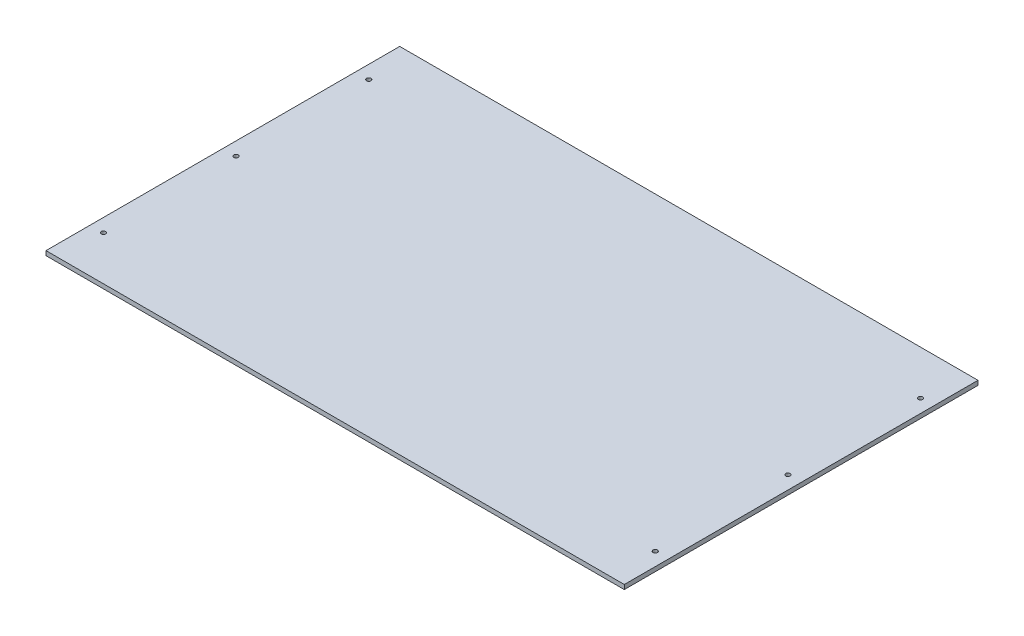
ISO-10303-21;
HEADER;
FILE_DESCRIPTION(('STEP AP214'),'2;1');
FILE_NAME('part.step','',(''),(''),'','','');
FILE_SCHEMA(('AUTOMOTIVE_DESIGN { 1 0 10303 214 1 1 1 1 }'));
ENDSEC;
DATA;
#1=APPLICATION_CONTEXT('core data for automotive mechanical design processes');
#2=APPLICATION_PROTOCOL_DEFINITION('international standard','automotive_design',2000,#1);
#3=PRODUCT_CONTEXT('',#1,'mechanical');
#4=PRODUCT('Part','Part','',(#3));
#5=PRODUCT_RELATED_PRODUCT_CATEGORY('part','',(#4));
#6=PRODUCT_DEFINITION_FORMATION('','',#4);
#7=PRODUCT_DEFINITION_CONTEXT('part definition',#1,'design');
#8=PRODUCT_DEFINITION('design','',#6,#7);
#9=PRODUCT_DEFINITION_SHAPE('','',#8);
#10=(LENGTH_UNIT() NAMED_UNIT(*) SI_UNIT(.MILLI.,.METRE.));
#11=(NAMED_UNIT(*) PLANE_ANGLE_UNIT() SI_UNIT($,.RADIAN.));
#12=(NAMED_UNIT(*) SI_UNIT($,.STERADIAN.) SOLID_ANGLE_UNIT());
#13=UNCERTAINTY_MEASURE_WITH_UNIT(LENGTH_MEASURE(1.E-05),#10,'distance_accuracy_value','');
#14=(GEOMETRIC_REPRESENTATION_CONTEXT(3) GLOBAL_UNCERTAINTY_ASSIGNED_CONTEXT((#13)) GLOBAL_UNIT_ASSIGNED_CONTEXT((#10,
#11,#12)) REPRESENTATION_CONTEXT('',''));
#15=CARTESIAN_POINT('',(0.,0.,0.));
#16=DIRECTION('',(0.,0.,1.));
#17=DIRECTION('',(1.,0.,0.));
#18=AXIS2_PLACEMENT_3D('',#15,#16,#17);
#19=CARTESIAN_POINT('',(0.,5.,0.));
#20=DIRECTION('',(1.,0.,0.));
#21=DIRECTION('',(0.,0.,-1.));
#22=AXIS2_PLACEMENT_3D('',#19,#20,#21);
#23=PLANE('',#22);
#24=DIRECTION('',(0.,0.,1.));
#25=VECTOR('',#24,1.);
#26=CARTESIAN_POINT('',(0.,0.,0.));
#27=LINE('',#26,#25);
#28=CARTESIAN_POINT('',(0.,0.,-400.));
#29=VERTEX_POINT('',#28);
#30=CARTESIAN_POINT('',(0.,0.,0.));
#31=VERTEX_POINT('',#30);
#32=EDGE_CURVE('E100',#29,#31,#27,.T.);
#33=ORIENTED_EDGE('',*,*,#32,.T.);
#34=DIRECTION('',(0.,-1.,0.));
#35=VECTOR('',#34,1.);
#36=CARTESIAN_POINT('',(0.,5.,0.));
#37=LINE('',#36,#35);
#38=CARTESIAN_POINT('',(0.,5.,0.));
#39=VERTEX_POINT('',#38);
#40=EDGE_CURVE('E11',#39,#31,#37,.T.);
#41=ORIENTED_EDGE('',*,*,#40,.F.);
#42=DIRECTION('',(0.,0.,1.));
#43=VECTOR('',#42,1.);
#44=CARTESIAN_POINT('',(0.,5.,0.));
#45=LINE('',#44,#43);
#46=CARTESIAN_POINT('',(0.,5.,-400.));
#47=VERTEX_POINT('',#46);
#48=EDGE_CURVE('E88',#47,#39,#45,.T.);
#49=ORIENTED_EDGE('',*,*,#48,.F.);
#50=DIRECTION('',(0.,-1.,0.));
#51=VECTOR('',#50,1.);
#52=CARTESIAN_POINT('',(0.,5.,-400.));
#53=LINE('',#52,#51);
#54=EDGE_CURVE('E96',#47,#29,#53,.T.);
#55=ORIENTED_EDGE('',*,*,#54,.T.);
#56=EDGE_LOOP('',(#33,#41,#49,#55));
#57=FACE_BOUND('',#56,.T.);
#58=ADVANCED_FACE('F37',(#57),#23,.F.);
#59=CARTESIAN_POINT('',(0.,5.,0.));
#60=DIRECTION('',(0.,0.,-1.));
#61=DIRECTION('',(-1.,0.,0.));
#62=AXIS2_PLACEMENT_3D('',#59,#60,#61);
#63=PLANE('',#62);
#64=DIRECTION('',(1.,0.,0.));
#65=VECTOR('',#64,1.);
#66=CARTESIAN_POINT('',(0.,0.,0.));
#67=LINE('',#66,#65);
#68=CARTESIAN_POINT('',(654.,0.,0.));
#69=VERTEX_POINT('',#68);
#70=EDGE_CURVE('E92',#31,#69,#67,.T.);
#71=ORIENTED_EDGE('',*,*,#70,.T.);
#72=DIRECTION('',(0.,-1.,0.));
#73=VECTOR('',#72,1.);
#74=CARTESIAN_POINT('',(654.,5.,0.));
#75=LINE('',#74,#73);
#76=CARTESIAN_POINT('',(654.,5.,0.));
#77=VERTEX_POINT('',#76);
#78=EDGE_CURVE('E45',#77,#69,#75,.T.);
#79=ORIENTED_EDGE('',*,*,#78,.F.);
#80=DIRECTION('',(1.,0.,0.));
#81=VECTOR('',#80,1.);
#82=CARTESIAN_POINT('',(0.,5.,0.));
#83=LINE('',#82,#81);
#84=EDGE_CURVE('E83',#39,#77,#83,.T.);
#85=ORIENTED_EDGE('',*,*,#84,.F.);
#86=ORIENTED_EDGE('',*,*,#40,.T.);
#87=EDGE_LOOP('',(#71,#79,#85,#86));
#88=FACE_BOUND('',#87,.T.);
#89=ADVANCED_FACE('F91',(#88),#63,.F.);
#90=CARTESIAN_POINT('',(654.,5.,0.));
#91=DIRECTION('',(-1.,0.,0.));
#92=DIRECTION('',(0.,0.,1.));
#93=AXIS2_PLACEMENT_3D('',#90,#91,#92);
#94=PLANE('',#93);
#95=DIRECTION('',(0.,0.,-1.));
#96=VECTOR('',#95,1.);
#97=CARTESIAN_POINT('',(654.,0.,0.));
#98=LINE('',#97,#96);
#99=CARTESIAN_POINT('',(654.,0.,-400.));
#100=VERTEX_POINT('',#99);
#101=EDGE_CURVE('E70',#69,#100,#98,.T.);
#102=ORIENTED_EDGE('',*,*,#101,.T.);
#103=DIRECTION('',(0.,-1.,0.));
#104=VECTOR('',#103,1.);
#105=CARTESIAN_POINT('',(654.,5.,-400.));
#106=LINE('',#105,#104);
#107=CARTESIAN_POINT('',(654.,5.,-400.));
#108=VERTEX_POINT('',#107);
#109=EDGE_CURVE('E93',#108,#100,#106,.T.);
#110=ORIENTED_EDGE('',*,*,#109,.F.);
#111=DIRECTION('',(0.,0.,-1.));
#112=VECTOR('',#111,1.);
#113=CARTESIAN_POINT('',(654.,5.,0.));
#114=LINE('',#113,#112);
#115=EDGE_CURVE('E86',#77,#108,#114,.T.);
#116=ORIENTED_EDGE('',*,*,#115,.F.);
#117=ORIENTED_EDGE('',*,*,#78,.T.);
#118=EDGE_LOOP('',(#102,#110,#116,#117));
#119=FACE_BOUND('',#118,.T.);
#120=ADVANCED_FACE('F94',(#119),#94,.F.);
#121=CARTESIAN_POINT('',(0.,5.,-400.));
#122=DIRECTION('',(0.,0.,1.));
#123=DIRECTION('',(1.,0.,0.));
#124=AXIS2_PLACEMENT_3D('',#121,#122,#123);
#125=PLANE('',#124);
#126=DIRECTION('',(-1.,0.,0.));
#127=VECTOR('',#126,1.);
#128=CARTESIAN_POINT('',(0.,0.,-400.));
#129=LINE('',#128,#127);
#130=EDGE_CURVE('E76',#100,#29,#129,.T.);
#131=ORIENTED_EDGE('',*,*,#130,.T.);
#132=ORIENTED_EDGE('',*,*,#54,.F.);
#133=DIRECTION('',(-1.,0.,0.));
#134=VECTOR('',#133,1.);
#135=CARTESIAN_POINT('',(0.,5.,-400.));
#136=LINE('',#135,#134);
#137=EDGE_CURVE('E53',#108,#47,#136,.T.);
#138=ORIENTED_EDGE('',*,*,#137,.F.);
#139=ORIENTED_EDGE('',*,*,#109,.T.);
#140=EDGE_LOOP('',(#131,#132,#138,#139));
#141=FACE_BOUND('',#140,.T.);
#142=ADVANCED_FACE('F108',(#141),#125,.F.);
#143=CARTESIAN_POINT('',(0.,5.,0.));
#144=DIRECTION('',(0.,-1.,0.));
#145=DIRECTION('',(0.,0.,-1.));
#146=AXIS2_PLACEMENT_3D('',#143,#144,#145);
#147=PLANE('',#146);
#148=CARTESIAN_POINT('',(639.,5.,-200.));
#149=DIRECTION('',(0.,1.,0.));
#150=DIRECTION('',(0.,0.,1.));
#151=AXIS2_PLACEMENT_3D('',#148,#149,#150);
#152=CIRCLE('',#151,2.49999999999991);
#153=CARTESIAN_POINT('',(639.,5.,-197.5));
#154=VERTEX_POINT('',#153);
#155=EDGE_CURVE('E117',#154,#154,#152,.T.);
#156=ORIENTED_EDGE('',*,*,#155,.F.);
#157=EDGE_LOOP('',(#156));
#158=FACE_BOUND('',#157,.T.);
#159=CARTESIAN_POINT('',(639.,5.,-50.));
#160=DIRECTION('',(0.,1.,0.));
#161=DIRECTION('',(0.,0.,1.));
#162=AXIS2_PLACEMENT_3D('',#159,#160,#161);
#163=CIRCLE('',#162,2.49999999999991);
#164=CARTESIAN_POINT('',(639.,5.,-47.5000000000001));
#165=VERTEX_POINT('',#164);
#166=EDGE_CURVE('E136',#165,#165,#163,.T.);
#167=ORIENTED_EDGE('',*,*,#166,.F.);
#168=EDGE_LOOP('',(#167));
#169=FACE_BOUND('',#168,.T.);
#170=CARTESIAN_POINT('',(15.,5.,-350.));
#171=DIRECTION('',(0.,1.,0.));
#172=DIRECTION('',(0.,0.,1.));
#173=AXIS2_PLACEMENT_3D('',#170,#171,#172);
#174=CIRCLE('',#173,2.5);
#175=CARTESIAN_POINT('',(15.,5.,-347.5));
#176=VERTEX_POINT('',#175);
#177=EDGE_CURVE('E130',#176,#176,#174,.T.);
#178=ORIENTED_EDGE('',*,*,#177,.F.);
#179=EDGE_LOOP('',(#178));
#180=FACE_BOUND('',#179,.T.);
#181=CARTESIAN_POINT('',(15.,5.,-200.));
#182=DIRECTION('',(0.,1.,0.));
#183=DIRECTION('',(0.,0.,1.));
#184=AXIS2_PLACEMENT_3D('',#181,#182,#183);
#185=CIRCLE('',#184,2.5);
#186=CARTESIAN_POINT('',(15.,5.,-197.5));
#187=VERTEX_POINT('',#186);
#188=EDGE_CURVE('E123',#187,#187,#185,.T.);
#189=ORIENTED_EDGE('',*,*,#188,.F.);
#190=EDGE_LOOP('',(#189));
#191=FACE_BOUND('',#190,.T.);
#192=CARTESIAN_POINT('',(15.,5.,-50.));
#193=DIRECTION('',(0.,1.,0.));
#194=DIRECTION('',(0.,0.,1.));
#195=AXIS2_PLACEMENT_3D('',#192,#193,#194);
#196=CIRCLE('',#195,2.5);
#197=CARTESIAN_POINT('',(15.,5.,-47.5));
#198=VERTEX_POINT('',#197);
#199=EDGE_CURVE('E124',#198,#198,#196,.T.);
#200=ORIENTED_EDGE('',*,*,#199,.F.);
#201=EDGE_LOOP('',(#200));
#202=FACE_BOUND('',#201,.T.);
#203=CARTESIAN_POINT('',(639.,5.,-350.));
#204=DIRECTION('',(0.,1.,0.));
#205=DIRECTION('',(0.,0.,1.));
#206=AXIS2_PLACEMENT_3D('',#203,#204,#205);
#207=CIRCLE('',#206,2.49999999999992);
#208=CARTESIAN_POINT('',(639.,5.,-347.5));
#209=VERTEX_POINT('',#208);
#210=EDGE_CURVE('E114',#209,#209,#207,.T.);
#211=ORIENTED_EDGE('',*,*,#210,.F.);
#212=EDGE_LOOP('',(#211));
#213=FACE_BOUND('',#212,.T.);
#214=ORIENTED_EDGE('',*,*,#48,.T.);
#215=ORIENTED_EDGE('',*,*,#84,.T.);
#216=ORIENTED_EDGE('',*,*,#115,.T.);
#217=ORIENTED_EDGE('',*,*,#137,.T.);
#218=EDGE_LOOP('',(#214,#215,#216,#217));
#219=FACE_BOUND('',#218,.T.);
#220=ADVANCED_FACE('F84',(#158,#169,#180,#191,#202,#213,#219),#147,.F.);
#221=CARTESIAN_POINT('',(0.,0.,0.));
#222=DIRECTION('',(0.,-1.,0.));
#223=DIRECTION('',(0.,0.,-1.));
#224=AXIS2_PLACEMENT_3D('',#221,#222,#223);
#225=PLANE('',#224);
#226=CARTESIAN_POINT('',(639.,0.,-200.));
#227=DIRECTION('',(0.,1.,0.));
#228=DIRECTION('',(0.,0.,1.));
#229=AXIS2_PLACEMENT_3D('',#226,#227,#228);
#230=CIRCLE('',#229,2.49999999999991);
#231=CARTESIAN_POINT('',(639.,0.,-197.5));
#232=VERTEX_POINT('',#231);
#233=EDGE_CURVE('E139',#232,#232,#230,.T.);
#234=ORIENTED_EDGE('',*,*,#233,.T.);
#235=EDGE_LOOP('',(#234));
#236=FACE_BOUND('',#235,.T.);
#237=CARTESIAN_POINT('',(639.,0.,-50.));
#238=DIRECTION('',(0.,1.,0.));
#239=DIRECTION('',(0.,0.,1.));
#240=AXIS2_PLACEMENT_3D('',#237,#238,#239);
#241=CIRCLE('',#240,2.49999999999991);
#242=CARTESIAN_POINT('',(639.,0.,-47.5000000000001));
#243=VERTEX_POINT('',#242);
#244=EDGE_CURVE('E133',#243,#243,#241,.T.);
#245=ORIENTED_EDGE('',*,*,#244,.T.);
#246=EDGE_LOOP('',(#245));
#247=FACE_BOUND('',#246,.T.);
#248=CARTESIAN_POINT('',(15.,0.,-350.));
#249=DIRECTION('',(0.,1.,0.));
#250=DIRECTION('',(0.,0.,1.));
#251=AXIS2_PLACEMENT_3D('',#248,#249,#250);
#252=CIRCLE('',#251,2.5);
#253=CARTESIAN_POINT('',(15.,0.,-347.5));
#254=VERTEX_POINT('',#253);
#255=EDGE_CURVE('E127',#254,#254,#252,.T.);
#256=ORIENTED_EDGE('',*,*,#255,.T.);
#257=EDGE_LOOP('',(#256));
#258=FACE_BOUND('',#257,.T.);
#259=CARTESIAN_POINT('',(15.,0.,-200.));
#260=DIRECTION('',(0.,1.,0.));
#261=DIRECTION('',(0.,0.,1.));
#262=AXIS2_PLACEMENT_3D('',#259,#260,#261);
#263=CIRCLE('',#262,2.5);
#264=CARTESIAN_POINT('',(15.,0.,-197.5));
#265=VERTEX_POINT('',#264);
#266=EDGE_CURVE('E120',#265,#265,#263,.T.);
#267=ORIENTED_EDGE('',*,*,#266,.T.);
#268=EDGE_LOOP('',(#267));
#269=FACE_BOUND('',#268,.T.);
#270=CARTESIAN_POINT('',(15.,0.,-50.));
#271=DIRECTION('',(0.,1.,0.));
#272=DIRECTION('',(0.,0.,1.));
#273=AXIS2_PLACEMENT_3D('',#270,#271,#272);
#274=CIRCLE('',#273,2.5);
#275=CARTESIAN_POINT('',(15.,0.,-47.5));
#276=VERTEX_POINT('',#275);
#277=EDGE_CURVE('E144',#276,#276,#274,.T.);
#278=ORIENTED_EDGE('',*,*,#277,.T.);
#279=EDGE_LOOP('',(#278));
#280=FACE_BOUND('',#279,.T.);
#281=CARTESIAN_POINT('',(639.,0.,-350.));
#282=DIRECTION('',(0.,1.,0.));
#283=DIRECTION('',(0.,0.,1.));
#284=AXIS2_PLACEMENT_3D('',#281,#282,#283);
#285=CIRCLE('',#284,2.49999999999992);
#286=CARTESIAN_POINT('',(639.,0.,-347.5));
#287=VERTEX_POINT('',#286);
#288=EDGE_CURVE('E103',#287,#287,#285,.T.);
#289=ORIENTED_EDGE('',*,*,#288,.T.);
#290=EDGE_LOOP('',(#289));
#291=FACE_BOUND('',#290,.T.);
#292=ORIENTED_EDGE('',*,*,#32,.F.);
#293=ORIENTED_EDGE('',*,*,#130,.F.);
#294=ORIENTED_EDGE('',*,*,#101,.F.);
#295=ORIENTED_EDGE('',*,*,#70,.F.);
#296=EDGE_LOOP('',(#292,#293,#294,#295));
#297=FACE_BOUND('',#296,.T.);
#298=ADVANCED_FACE('F111',(#236,#247,#258,#269,#280,#291,#297),#225,.T.);
#299=CARTESIAN_POINT('',(639.,0.,-350.));
#300=DIRECTION('',(0.,1.,0.));
#301=DIRECTION('',(0.,0.,1.));
#302=AXIS2_PLACEMENT_3D('',#299,#300,#301);
#303=CYLINDRICAL_SURFACE('',#302,2.49999999999992);
#304=ORIENTED_EDGE('',*,*,#288,.F.);
#305=EDGE_LOOP('',(#304));
#306=FACE_BOUND('',#305,.T.);
#307=ORIENTED_EDGE('',*,*,#210,.T.);
#308=EDGE_LOOP('',(#307));
#309=FACE_BOUND('',#308,.T.);
#310=ADVANCED_FACE('F158',(#306,#309),#303,.F.);
#311=CARTESIAN_POINT('',(15.,0.,-50.));
#312=DIRECTION('',(0.,1.,0.));
#313=DIRECTION('',(0.,0.,1.));
#314=AXIS2_PLACEMENT_3D('',#311,#312,#313);
#315=CYLINDRICAL_SURFACE('',#314,2.5);
#316=ORIENTED_EDGE('',*,*,#277,.F.);
#317=EDGE_LOOP('',(#316));
#318=FACE_BOUND('',#317,.T.);
#319=ORIENTED_EDGE('',*,*,#199,.T.);
#320=EDGE_LOOP('',(#319));
#321=FACE_BOUND('',#320,.T.);
#322=ADVANCED_FACE('F150',(#318,#321),#315,.F.);
#323=CARTESIAN_POINT('',(15.,0.,-200.));
#324=DIRECTION('',(0.,1.,0.));
#325=DIRECTION('',(0.,0.,1.));
#326=AXIS2_PLACEMENT_3D('',#323,#324,#325);
#327=CYLINDRICAL_SURFACE('',#326,2.5);
#328=ORIENTED_EDGE('',*,*,#266,.F.);
#329=EDGE_LOOP('',(#328));
#330=FACE_BOUND('',#329,.T.);
#331=ORIENTED_EDGE('',*,*,#188,.T.);
#332=EDGE_LOOP('',(#331));
#333=FACE_BOUND('',#332,.T.);
#334=ADVANCED_FACE('F166',(#330,#333),#327,.F.);
#335=CARTESIAN_POINT('',(15.,0.,-350.));
#336=DIRECTION('',(0.,1.,0.));
#337=DIRECTION('',(0.,0.,1.));
#338=AXIS2_PLACEMENT_3D('',#335,#336,#337);
#339=CYLINDRICAL_SURFACE('',#338,2.5);
#340=ORIENTED_EDGE('',*,*,#255,.F.);
#341=EDGE_LOOP('',(#340));
#342=FACE_BOUND('',#341,.T.);
#343=ORIENTED_EDGE('',*,*,#177,.T.);
#344=EDGE_LOOP('',(#343));
#345=FACE_BOUND('',#344,.T.);
#346=ADVANCED_FACE('F220',(#342,#345),#339,.F.);
#347=CARTESIAN_POINT('',(639.,0.,-50.));
#348=DIRECTION('',(0.,1.,0.));
#349=DIRECTION('',(0.,0.,1.));
#350=AXIS2_PLACEMENT_3D('',#347,#348,#349);
#351=CYLINDRICAL_SURFACE('',#350,2.49999999999991);
#352=ORIENTED_EDGE('',*,*,#244,.F.);
#353=EDGE_LOOP('',(#352));
#354=FACE_BOUND('',#353,.T.);
#355=ORIENTED_EDGE('',*,*,#166,.T.);
#356=EDGE_LOOP('',(#355));
#357=FACE_BOUND('',#356,.T.);
#358=ADVANCED_FACE('F230',(#354,#357),#351,.F.);
#359=CARTESIAN_POINT('',(639.,0.,-200.));
#360=DIRECTION('',(0.,1.,0.));
#361=DIRECTION('',(0.,0.,1.));
#362=AXIS2_PLACEMENT_3D('',#359,#360,#361);
#363=CYLINDRICAL_SURFACE('',#362,2.49999999999991);
#364=ORIENTED_EDGE('',*,*,#233,.F.);
#365=EDGE_LOOP('',(#364));
#366=FACE_BOUND('',#365,.T.);
#367=ORIENTED_EDGE('',*,*,#155,.T.);
#368=EDGE_LOOP('',(#367));
#369=FACE_BOUND('',#368,.T.);
#370=ADVANCED_FACE('F241',(#366,#369),#363,.F.);
#371=CLOSED_SHELL('',(#58,#89,#120,#142,#220,#298,#310,#322,#334,#346,#358,#370));
#372=MANIFOLD_SOLID_BREP('B2',#371);
#373=ADVANCED_BREP_SHAPE_REPRESENTATION('',(#18,#372),#14);
#374=SHAPE_DEFINITION_REPRESENTATION(#9,#373);
ENDSEC;
END-ISO-10303-21;
